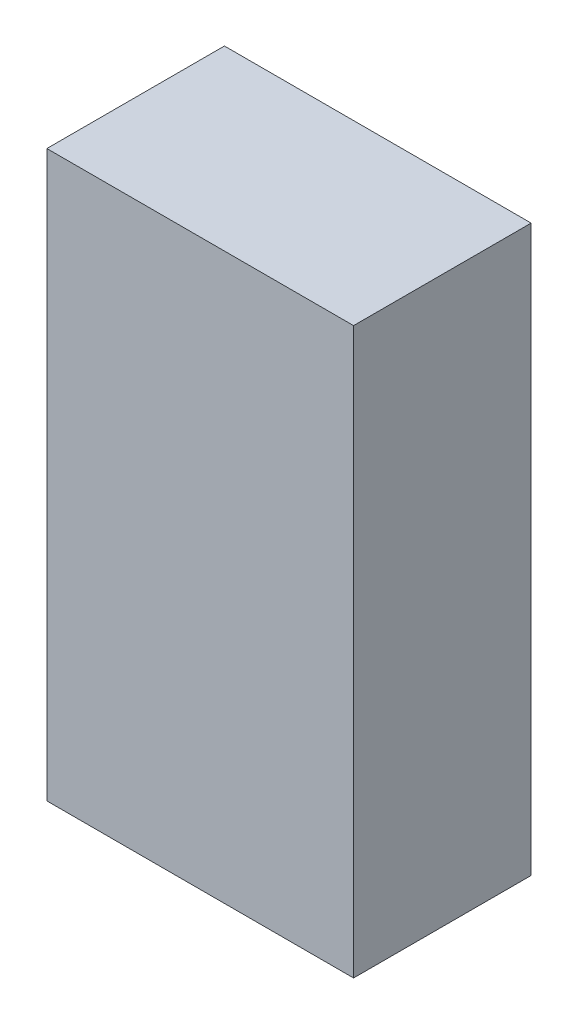
ISO-10303-21;
HEADER;
FILE_DESCRIPTION(('STEP AP214'),'2;1');
FILE_NAME('part.step','',(''),(''),'','','');
FILE_SCHEMA(('AUTOMOTIVE_DESIGN { 1 0 10303 214 1 1 1 1 }'));
ENDSEC;
DATA;
#1=APPLICATION_CONTEXT('core data for automotive mechanical design processes');
#2=APPLICATION_PROTOCOL_DEFINITION('international standard','automotive_design',2000,#1);
#3=PRODUCT_CONTEXT('',#1,'mechanical');
#4=PRODUCT('Part','Part','',(#3));
#5=PRODUCT_RELATED_PRODUCT_CATEGORY('part','',(#4));
#6=PRODUCT_DEFINITION_FORMATION('','',#4);
#7=PRODUCT_DEFINITION_CONTEXT('part definition',#1,'design');
#8=PRODUCT_DEFINITION('design','',#6,#7);
#9=PRODUCT_DEFINITION_SHAPE('','',#8);
#10=(LENGTH_UNIT() NAMED_UNIT(*) SI_UNIT(.MILLI.,.METRE.));
#11=(NAMED_UNIT(*) PLANE_ANGLE_UNIT() SI_UNIT($,.RADIAN.));
#12=(NAMED_UNIT(*) SI_UNIT($,.STERADIAN.) SOLID_ANGLE_UNIT());
#13=UNCERTAINTY_MEASURE_WITH_UNIT(LENGTH_MEASURE(1.E-05),#10,'distance_accuracy_value','');
#14=(GEOMETRIC_REPRESENTATION_CONTEXT(3) GLOBAL_UNCERTAINTY_ASSIGNED_CONTEXT((#13)) GLOBAL_UNIT_ASSIGNED_CONTEXT((#10,
#11,#12)) REPRESENTATION_CONTEXT('',''));
#15=CARTESIAN_POINT('',(0.,0.,0.));
#16=DIRECTION('',(0.,0.,1.));
#17=DIRECTION('',(1.,0.,0.));
#18=AXIS2_PLACEMENT_3D('',#15,#16,#17);
#19=CARTESIAN_POINT('',(0.47500032,-0.87499698,0.5499989));
#20=DIRECTION('',(0.,0.,-1.));
#21=DIRECTION('',(-1.,0.,0.));
#22=AXIS2_PLACEMENT_3D('',#19,#20,#21);
#23=PLANE('',#22);
#24=DIRECTION('',(1.,0.,0.));
#25=VECTOR('',#24,1.);
#26=CARTESIAN_POINT('',(0.47499778,0.87499952,0.5499989));
#27=LINE('',#26,#25);
#28=CARTESIAN_POINT('',(0.474997780000001,0.87499952,0.5499989));
#29=VERTEX_POINT('',#28);
#30=CARTESIAN_POINT('',(-0.47500032,0.87499952,0.5499989));
#31=VERTEX_POINT('',#30);
#32=EDGE_CURVE('E55',#29,#31,#27,.F.);
#33=ORIENTED_EDGE('',*,*,#32,.T.);
#34=DIRECTION('',(0.,1.,0.));
#35=VECTOR('',#34,1.);
#36=CARTESIAN_POINT('',(-0.47500032,0.87499952,0.5499989));
#37=LINE('',#36,#35);
#38=CARTESIAN_POINT('',(-0.47500032,-0.87499825,0.5499989));
#39=VERTEX_POINT('',#38);
#40=EDGE_CURVE('E57',#31,#39,#37,.F.);
#41=ORIENTED_EDGE('',*,*,#40,.T.);
#42=DIRECTION('',(-0.999999999996426,-2.67368243605814E-06,0.));
#43=VECTOR('',#42,1.);
#44=CARTESIAN_POINT('',(-0.47500032,-0.87499952,0.5499989));
#45=LINE('',#44,#43);
#46=CARTESIAN_POINT('',(0.474999685,-0.874996979999987,0.5499989));
#47=VERTEX_POINT('',#46);
#48=EDGE_CURVE('E20',#39,#47,#45,.F.);
#49=ORIENTED_EDGE('',*,*,#48,.T.);
#50=DIRECTION('',(1.45143147257392E-06,-0.999999999998947,0.));
#51=VECTOR('',#50,1.);
#52=CARTESIAN_POINT('',(0.47500032,-0.87499698,0.5499989));
#53=LINE('',#52,#51);
#54=EDGE_CURVE('E80',#47,#29,#53,.F.);
#55=ORIENTED_EDGE('',*,*,#54,.T.);
#56=EDGE_LOOP('',(#33,#41,#49,#55));
#57=FACE_BOUND('',#56,.T.);
#58=ADVANCED_FACE('F17',(#57),#23,.F.);
#59=CARTESIAN_POINT('',(-0.47500032,-0.87499952,0.));
#60=DIRECTION('',(-2.67368243605814E-06,0.999999999996426,0.));
#61=DIRECTION('',(-0.999999999996426,-2.67368243605814E-06,0.));
#62=AXIS2_PLACEMENT_3D('',#59,#60,#61);
#63=PLANE('',#62);
#64=DIRECTION('',(0.,0.,1.));
#65=VECTOR('',#64,1.);
#66=CARTESIAN_POINT('',(0.47500032,-0.87499698,0.));
#67=LINE('',#66,#65);
#68=CARTESIAN_POINT('',(0.474999685,-0.874996979999987,0.));
#69=VERTEX_POINT('',#68);
#70=EDGE_CURVE('E68',#69,#47,#67,.T.);
#71=ORIENTED_EDGE('',*,*,#70,.T.);
#72=ORIENTED_EDGE('',*,*,#48,.F.);
#73=DIRECTION('',(0.,0.,-1.));
#74=VECTOR('',#73,1.);
#75=CARTESIAN_POINT('',(-0.47500032,-0.87499952,0.));
#76=LINE('',#75,#74);
#77=CARTESIAN_POINT('',(-0.47500032,-0.874998885,0.));
#78=VERTEX_POINT('',#77);
#79=EDGE_CURVE('E63',#39,#78,#76,.T.);
#80=ORIENTED_EDGE('',*,*,#79,.T.);
#81=DIRECTION('',(-1.,0.,0.));
#82=VECTOR('',#81,1.);
#83=CARTESIAN_POINT('',(0.47500032,-0.87499698,0.));
#84=LINE('',#83,#82);
#85=EDGE_CURVE('E83',#69,#78,#84,.T.);
#86=ORIENTED_EDGE('',*,*,#85,.F.);
#87=EDGE_LOOP('',(#71,#72,#80,#86));
#88=FACE_BOUND('',#87,.T.);
#89=ADVANCED_FACE('F65',(#88),#63,.F.);
#90=CARTESIAN_POINT('',(-0.47500032,0.87499952,0.));
#91=DIRECTION('',(1.,0.,0.));
#92=DIRECTION('',(0.,0.,-1.));
#93=AXIS2_PLACEMENT_3D('',#90,#91,#92);
#94=PLANE('',#93);
#95=ORIENTED_EDGE('',*,*,#79,.F.);
#96=ORIENTED_EDGE('',*,*,#40,.F.);
#97=DIRECTION('',(0.,0.,-1.));
#98=VECTOR('',#97,1.);
#99=CARTESIAN_POINT('',(-0.47500032,0.87499952,0.));
#100=LINE('',#99,#98);
#101=CARTESIAN_POINT('',(-0.47500032,0.87499952,0.));
#102=VERTEX_POINT('',#101);
#103=EDGE_CURVE('E75',#31,#102,#100,.T.);
#104=ORIENTED_EDGE('',*,*,#103,.T.);
#105=DIRECTION('',(0.,1.,0.));
#106=VECTOR('',#105,1.);
#107=CARTESIAN_POINT('',(-0.47500032,-0.87499698,0.));
#108=LINE('',#107,#106);
#109=EDGE_CURVE('E72',#78,#102,#108,.T.);
#110=ORIENTED_EDGE('',*,*,#109,.F.);
#111=EDGE_LOOP('',(#95,#96,#104,#110));
#112=FACE_BOUND('',#111,.T.);
#113=ADVANCED_FACE('F70',(#112),#94,.F.);
#114=CARTESIAN_POINT('',(0.47499778,0.87499952,0.));
#115=DIRECTION('',(0.,-1.,0.));
#116=DIRECTION('',(0.,0.,-1.));
#117=AXIS2_PLACEMENT_3D('',#114,#115,#116);
#118=PLANE('',#117);
#119=ORIENTED_EDGE('',*,*,#103,.F.);
#120=ORIENTED_EDGE('',*,*,#32,.F.);
#121=DIRECTION('',(0.,0.,1.));
#122=VECTOR('',#121,1.);
#123=CARTESIAN_POINT('',(0.474997780000003,0.87499952,0.));
#124=LINE('',#123,#122);
#125=CARTESIAN_POINT('',(0.474997780000001,0.87499952,0.));
#126=VERTEX_POINT('',#125);
#127=EDGE_CURVE('E35',#29,#126,#124,.F.);
#128=ORIENTED_EDGE('',*,*,#127,.T.);
#129=DIRECTION('',(-1.,0.,0.));
#130=VECTOR('',#129,1.);
#131=CARTESIAN_POINT('',(0.47500032,0.87499952,0.));
#132=LINE('',#131,#130);
#133=EDGE_CURVE('E26',#102,#126,#132,.F.);
#134=ORIENTED_EDGE('',*,*,#133,.F.);
#135=EDGE_LOOP('',(#119,#120,#128,#134));
#136=FACE_BOUND('',#135,.T.);
#137=ADVANCED_FACE('F89',(#136),#118,.F.);
#138=CARTESIAN_POINT('',(0.47500032,-0.87499698,0.));
#139=DIRECTION('',(-0.999999999998947,-1.45143147257392E-06,0.));
#140=DIRECTION('',(1.45143147257392E-06,-0.999999999998947,0.));
#141=AXIS2_PLACEMENT_3D('',#138,#139,#140);
#142=PLANE('',#141);
#143=ORIENTED_EDGE('',*,*,#127,.F.);
#144=ORIENTED_EDGE('',*,*,#54,.F.);
#145=ORIENTED_EDGE('',*,*,#70,.F.);
#146=DIRECTION('',(0.,1.,0.));
#147=VECTOR('',#146,1.);
#148=CARTESIAN_POINT('',(0.47499778,-0.87499698,0.));
#149=LINE('',#148,#147);
#150=EDGE_CURVE('E11',#126,#69,#149,.F.);
#151=ORIENTED_EDGE('',*,*,#150,.F.);
#152=EDGE_LOOP('',(#143,#144,#145,#151));
#153=FACE_BOUND('',#152,.T.);
#154=ADVANCED_FACE('F91',(#153),#142,.F.);
#155=CARTESIAN_POINT('',(0.47500032,-0.87499698,0.));
#156=DIRECTION('',(0.,0.,-1.));
#157=DIRECTION('',(-1.,0.,0.));
#158=AXIS2_PLACEMENT_3D('',#155,#156,#157);
#159=PLANE('',#158);
#160=ORIENTED_EDGE('',*,*,#133,.T.);
#161=ORIENTED_EDGE('',*,*,#150,.T.);
#162=ORIENTED_EDGE('',*,*,#85,.T.);
#163=ORIENTED_EDGE('',*,*,#109,.T.);
#164=EDGE_LOOP('',(#160,#161,#162,#163));
#165=FACE_BOUND('',#164,.T.);
#166=ADVANCED_FACE('F88',(#165),#159,.T.);
#167=CLOSED_SHELL('',(#58,#89,#113,#137,#154,#166));
#168=MANIFOLD_SOLID_BREP('B1',#167);
#169=ADVANCED_BREP_SHAPE_REPRESENTATION('',(#18,#168),#14);
#170=SHAPE_DEFINITION_REPRESENTATION(#9,#169);
ENDSEC;
END-ISO-10303-21;
